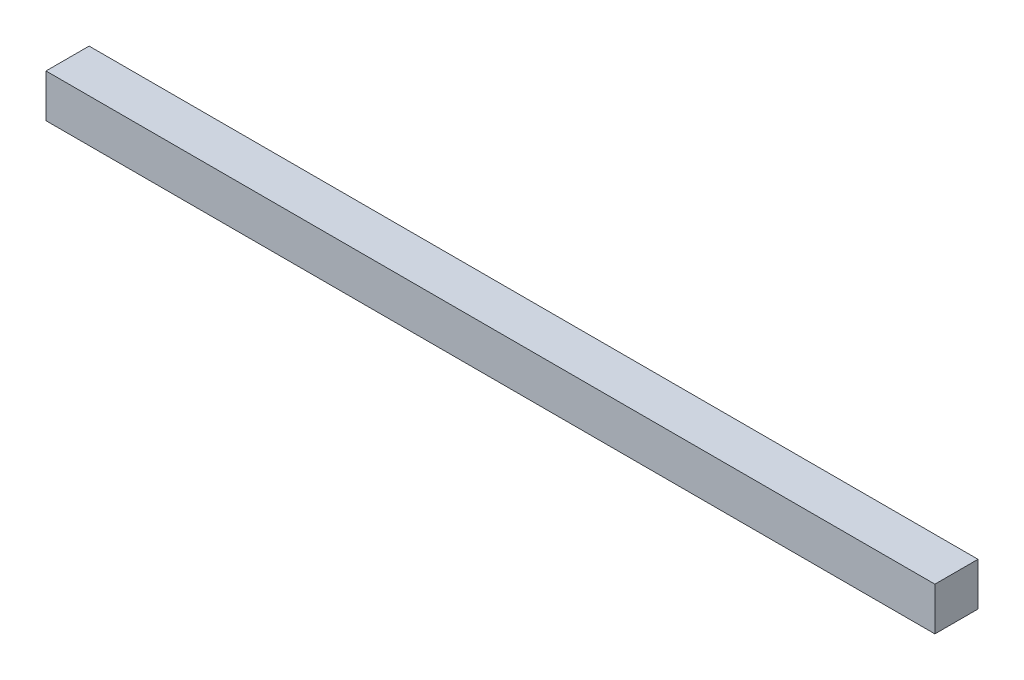
ISO-10303-21;
HEADER;
FILE_DESCRIPTION(('STEP AP214'),'2;1');
FILE_NAME('part.step','',(''),(''),'','','');
FILE_SCHEMA(('AUTOMOTIVE_DESIGN { 1 0 10303 214 1 1 1 1 }'));
ENDSEC;
DATA;
#1=APPLICATION_CONTEXT('core data for automotive mechanical design processes');
#2=APPLICATION_PROTOCOL_DEFINITION('international standard','automotive_design',2000,#1);
#3=PRODUCT_CONTEXT('',#1,'mechanical');
#4=PRODUCT('Part','Part','',(#3));
#5=PRODUCT_RELATED_PRODUCT_CATEGORY('part','',(#4));
#6=PRODUCT_DEFINITION_FORMATION('','',#4);
#7=PRODUCT_DEFINITION_CONTEXT('part definition',#1,'design');
#8=PRODUCT_DEFINITION('design','',#6,#7);
#9=PRODUCT_DEFINITION_SHAPE('','',#8);
#10=(LENGTH_UNIT() NAMED_UNIT(*) SI_UNIT(.MILLI.,.METRE.));
#11=(NAMED_UNIT(*) PLANE_ANGLE_UNIT() SI_UNIT($,.RADIAN.));
#12=(NAMED_UNIT(*) SI_UNIT($,.STERADIAN.) SOLID_ANGLE_UNIT());
#13=UNCERTAINTY_MEASURE_WITH_UNIT(LENGTH_MEASURE(1.E-05),#10,'distance_accuracy_value','');
#14=(GEOMETRIC_REPRESENTATION_CONTEXT(3) GLOBAL_UNCERTAINTY_ASSIGNED_CONTEXT((#13)) GLOBAL_UNIT_ASSIGNED_CONTEXT((#10,
#11,#12)) REPRESENTATION_CONTEXT('',''));
#15=CARTESIAN_POINT('',(0.,0.,0.));
#16=DIRECTION('',(0.,0.,1.));
#17=DIRECTION('',(1.,0.,0.));
#18=AXIS2_PLACEMENT_3D('',#15,#16,#17);
#19=CARTESIAN_POINT('',(0.,1.6,1.6));
#20=DIRECTION('',(0.,-1.,0.));
#21=DIRECTION('',(0.,0.,1.));
#22=AXIS2_PLACEMENT_3D('',#19,#20,#21);
#23=PLANE('',#22);
#24=DIRECTION('',(0.,0.,-1.));
#25=VECTOR('',#24,1.);
#26=CARTESIAN_POINT('',(66.,1.60000000000023,1.6));
#27=LINE('',#26,#25);
#28=CARTESIAN_POINT('',(66.,1.60000000000023,1.6));
#29=VERTEX_POINT('',#28);
#30=CARTESIAN_POINT('',(66.,1.60000000000023,-1.6));
#31=VERTEX_POINT('',#30);
#32=EDGE_CURVE('E107',#29,#31,#27,.T.);
#33=ORIENTED_EDGE('',*,*,#32,.T.);
#34=DIRECTION('',(1.,0.,0.));
#35=VECTOR('',#34,1.);
#36=CARTESIAN_POINT('',(0.,1.6,-1.6));
#37=LINE('',#36,#35);
#38=CARTESIAN_POINT('',(0.,1.6,-1.6));
#39=VERTEX_POINT('',#38);
#40=EDGE_CURVE('E11',#39,#31,#37,.T.);
#41=ORIENTED_EDGE('',*,*,#40,.F.);
#42=DIRECTION('',(0.,0.,-1.));
#43=VECTOR('',#42,1.);
#44=CARTESIAN_POINT('',(0.,1.6,1.6));
#45=LINE('',#44,#43);
#46=CARTESIAN_POINT('',(0.,1.6,1.6));
#47=VERTEX_POINT('',#46);
#48=EDGE_CURVE('E95',#47,#39,#45,.T.);
#49=ORIENTED_EDGE('',*,*,#48,.F.);
#50=DIRECTION('',(1.,0.,0.));
#51=VECTOR('',#50,1.);
#52=CARTESIAN_POINT('',(0.,1.6,1.6));
#53=LINE('',#52,#51);
#54=EDGE_CURVE('E103',#47,#29,#53,.T.);
#55=ORIENTED_EDGE('',*,*,#54,.T.);
#56=EDGE_LOOP('',(#33,#41,#49,#55));
#57=FACE_BOUND('',#56,.T.);
#58=ADVANCED_FACE('F44',(#57),#23,.F.);
#59=CARTESIAN_POINT('',(0.,-1.6,-1.6));
#60=DIRECTION('',(0.,0.,1.));
#61=DIRECTION('',(0.,1.,0.));
#62=AXIS2_PLACEMENT_3D('',#59,#60,#61);
#63=PLANE('',#62);
#64=DIRECTION('',(0.,-1.,0.));
#65=VECTOR('',#64,1.);
#66=CARTESIAN_POINT('',(66.,-1.59999999999976,-1.6));
#67=LINE('',#66,#65);
#68=CARTESIAN_POINT('',(66.,-1.59999999999976,-1.6));
#69=VERTEX_POINT('',#68);
#70=EDGE_CURVE('E99',#31,#69,#67,.T.);
#71=ORIENTED_EDGE('',*,*,#70,.T.);
#72=DIRECTION('',(1.,0.,0.));
#73=VECTOR('',#72,1.);
#74=CARTESIAN_POINT('',(0.,-1.6,-1.6));
#75=LINE('',#74,#73);
#76=CARTESIAN_POINT('',(0.,-1.6,-1.6));
#77=VERTEX_POINT('',#76);
#78=EDGE_CURVE('E52',#77,#69,#75,.T.);
#79=ORIENTED_EDGE('',*,*,#78,.F.);
#80=DIRECTION('',(0.,-1.,0.));
#81=VECTOR('',#80,1.);
#82=CARTESIAN_POINT('',(0.,-1.6,-1.6));
#83=LINE('',#82,#81);
#84=EDGE_CURVE('E90',#39,#77,#83,.T.);
#85=ORIENTED_EDGE('',*,*,#84,.F.);
#86=ORIENTED_EDGE('',*,*,#40,.T.);
#87=EDGE_LOOP('',(#71,#79,#85,#86));
#88=FACE_BOUND('',#87,.T.);
#89=ADVANCED_FACE('F98',(#88),#63,.F.);
#90=CARTESIAN_POINT('',(0.,-1.6,1.6));
#91=DIRECTION('',(0.,1.,0.));
#92=DIRECTION('',(0.,0.,-1.));
#93=AXIS2_PLACEMENT_3D('',#90,#91,#92);
#94=PLANE('',#93);
#95=DIRECTION('',(0.,0.,1.));
#96=VECTOR('',#95,1.);
#97=CARTESIAN_POINT('',(66.,-1.59999999999976,1.6));
#98=LINE('',#97,#96);
#99=CARTESIAN_POINT('',(66.,-1.59999999999976,1.6));
#100=VERTEX_POINT('',#99);
#101=EDGE_CURVE('E77',#69,#100,#98,.T.);
#102=ORIENTED_EDGE('',*,*,#101,.T.);
#103=DIRECTION('',(1.,0.,0.));
#104=VECTOR('',#103,1.);
#105=CARTESIAN_POINT('',(0.,-1.6,1.6));
#106=LINE('',#105,#104);
#107=CARTESIAN_POINT('',(0.,-1.6,1.6));
#108=VERTEX_POINT('',#107);
#109=EDGE_CURVE('E100',#108,#100,#106,.T.);
#110=ORIENTED_EDGE('',*,*,#109,.F.);
#111=DIRECTION('',(0.,0.,1.));
#112=VECTOR('',#111,1.);
#113=CARTESIAN_POINT('',(0.,-1.6,1.6));
#114=LINE('',#113,#112);
#115=EDGE_CURVE('E93',#77,#108,#114,.T.);
#116=ORIENTED_EDGE('',*,*,#115,.F.);
#117=ORIENTED_EDGE('',*,*,#78,.T.);
#118=EDGE_LOOP('',(#102,#110,#116,#117));
#119=FACE_BOUND('',#118,.T.);
#120=ADVANCED_FACE('F101',(#119),#94,.F.);
#121=CARTESIAN_POINT('',(0.,-1.6,1.6));
#122=DIRECTION('',(0.,0.,-1.));
#123=DIRECTION('',(0.,-1.,0.));
#124=AXIS2_PLACEMENT_3D('',#121,#122,#123);
#125=PLANE('',#124);
#126=DIRECTION('',(0.,1.,0.));
#127=VECTOR('',#126,1.);
#128=CARTESIAN_POINT('',(66.,-1.59999999999976,1.6));
#129=LINE('',#128,#127);
#130=EDGE_CURVE('E83',#100,#29,#129,.T.);
#131=ORIENTED_EDGE('',*,*,#130,.T.);
#132=ORIENTED_EDGE('',*,*,#54,.F.);
#133=DIRECTION('',(0.,1.,0.));
#134=VECTOR('',#133,1.);
#135=CARTESIAN_POINT('',(0.,-1.6,1.6));
#136=LINE('',#135,#134);
#137=EDGE_CURVE('E60',#108,#47,#136,.T.);
#138=ORIENTED_EDGE('',*,*,#137,.F.);
#139=ORIENTED_EDGE('',*,*,#109,.T.);
#140=EDGE_LOOP('',(#131,#132,#138,#139));
#141=FACE_BOUND('',#140,.T.);
#142=ADVANCED_FACE('F114',(#141),#125,.F.);
#143=CARTESIAN_POINT('',(0.,0.,0.));
#144=DIRECTION('',(1.,0.,0.));
#145=DIRECTION('',(0.,0.,-1.));
#146=AXIS2_PLACEMENT_3D('',#143,#144,#145);
#147=PLANE('',#146);
#148=ORIENTED_EDGE('',*,*,#48,.T.);
#149=ORIENTED_EDGE('',*,*,#84,.T.);
#150=ORIENTED_EDGE('',*,*,#115,.T.);
#151=ORIENTED_EDGE('',*,*,#137,.T.);
#152=EDGE_LOOP('',(#148,#149,#150,#151));
#153=FACE_BOUND('',#152,.T.);
#154=ADVANCED_FACE('F91',(#153),#147,.F.);
#155=CARTESIAN_POINT('',(66.,2.35922392732846E-13,0.));
#156=DIRECTION('',(1.,0.,0.));
#157=DIRECTION('',(0.,0.,-1.));
#158=AXIS2_PLACEMENT_3D('',#155,#156,#157);
#159=PLANE('',#158);
#160=ORIENTED_EDGE('',*,*,#32,.F.);
#161=ORIENTED_EDGE('',*,*,#130,.F.);
#162=ORIENTED_EDGE('',*,*,#101,.F.);
#163=ORIENTED_EDGE('',*,*,#70,.F.);
#164=EDGE_LOOP('',(#160,#161,#162,#163));
#165=FACE_BOUND('',#164,.T.);
#166=ADVANCED_FACE('F117',(#165),#159,.T.);
#167=CLOSED_SHELL('',(#58,#89,#120,#142,#154,#166));
#168=MANIFOLD_SOLID_BREP('B2',#167);
#169=ADVANCED_BREP_SHAPE_REPRESENTATION('',(#18,#168),#14);
#170=SHAPE_DEFINITION_REPRESENTATION(#9,#169);
ENDSEC;
END-ISO-10303-21;
